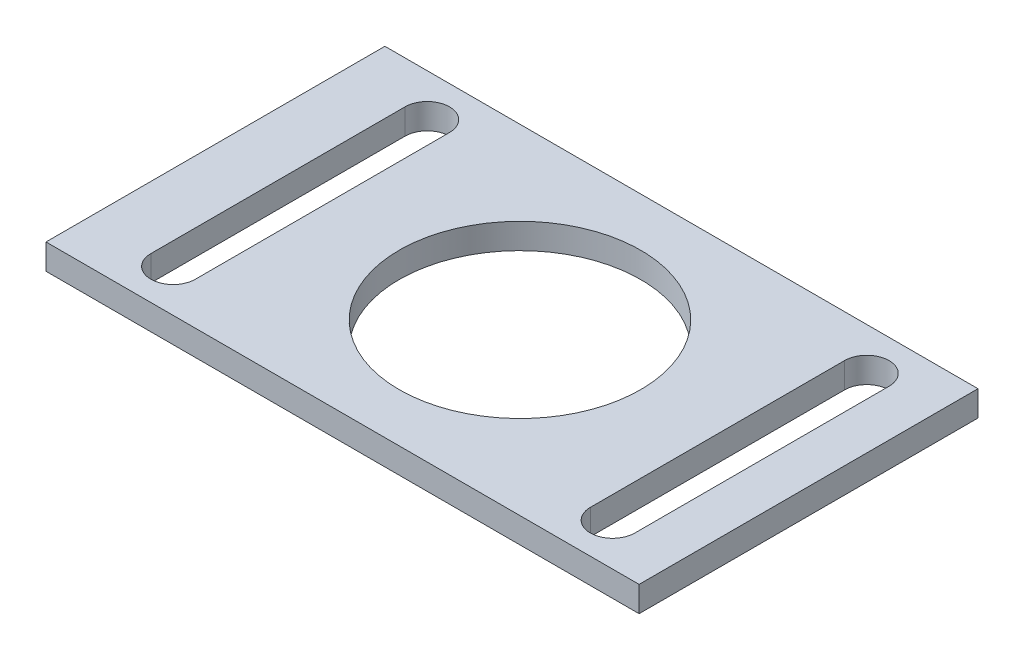
ISO-10303-21;
HEADER;
FILE_DESCRIPTION(('STEP AP214'),'2;1');
FILE_NAME('part.step','',(''),(''),'','','');
FILE_SCHEMA(('AUTOMOTIVE_DESIGN { 1 0 10303 214 1 1 1 1 }'));
ENDSEC;
DATA;
#1=APPLICATION_CONTEXT('core data for automotive mechanical design processes');
#2=APPLICATION_PROTOCOL_DEFINITION('international standard','automotive_design',2000,#1);
#3=PRODUCT_CONTEXT('',#1,'mechanical');
#4=PRODUCT('Part','Part','',(#3));
#5=PRODUCT_RELATED_PRODUCT_CATEGORY('part','',(#4));
#6=PRODUCT_DEFINITION_FORMATION('','',#4);
#7=PRODUCT_DEFINITION_CONTEXT('part definition',#1,'design');
#8=PRODUCT_DEFINITION('design','',#6,#7);
#9=PRODUCT_DEFINITION_SHAPE('','',#8);
#10=(LENGTH_UNIT() NAMED_UNIT(*) SI_UNIT(.MILLI.,.METRE.));
#11=(NAMED_UNIT(*) PLANE_ANGLE_UNIT() SI_UNIT($,.RADIAN.));
#12=(NAMED_UNIT(*) SI_UNIT($,.STERADIAN.) SOLID_ANGLE_UNIT());
#13=UNCERTAINTY_MEASURE_WITH_UNIT(LENGTH_MEASURE(1.E-05),#10,'distance_accuracy_value','');
#14=(GEOMETRIC_REPRESENTATION_CONTEXT(3) GLOBAL_UNCERTAINTY_ASSIGNED_CONTEXT((#13)) GLOBAL_UNIT_ASSIGNED_CONTEXT((#10,
#11,#12)) REPRESENTATION_CONTEXT('',''));
#15=CARTESIAN_POINT('',(0.,0.,0.));
#16=DIRECTION('',(0.,0.,1.));
#17=DIRECTION('',(1.,0.,0.));
#18=AXIS2_PLACEMENT_3D('',#15,#16,#17);
#19=CARTESIAN_POINT('',(0.,3.,0.));
#20=DIRECTION('',(-1.,0.,0.));
#21=DIRECTION('',(0.,0.,1.));
#22=AXIS2_PLACEMENT_3D('',#19,#20,#21);
#23=PLANE('',#22);
#24=DIRECTION('',(0.,0.,-1.));
#25=VECTOR('',#24,1.);
#26=CARTESIAN_POINT('',(0.,0.,0.));
#27=LINE('',#26,#25);
#28=CARTESIAN_POINT('',(0.,0.,0.));
#29=VERTEX_POINT('',#28);
#30=CARTESIAN_POINT('',(0.,0.,-40.));
#31=VERTEX_POINT('',#30);
#32=EDGE_CURVE('E196',#29,#31,#27,.T.);
#33=ORIENTED_EDGE('',*,*,#32,.F.);
#34=DIRECTION('',(0.,-1.,0.));
#35=VECTOR('',#34,1.);
#36=CARTESIAN_POINT('',(0.,3.,0.));
#37=LINE('',#36,#35);
#38=CARTESIAN_POINT('',(0.,3.,0.));
#39=VERTEX_POINT('',#38);
#40=EDGE_CURVE('E11',#39,#29,#37,.T.);
#41=ORIENTED_EDGE('',*,*,#40,.F.);
#42=DIRECTION('',(0.,0.,-1.));
#43=VECTOR('',#42,1.);
#44=CARTESIAN_POINT('',(0.,3.,0.));
#45=LINE('',#44,#43);
#46=CARTESIAN_POINT('',(0.,3.,-40.));
#47=VERTEX_POINT('',#46);
#48=EDGE_CURVE('E199',#39,#47,#45,.T.);
#49=ORIENTED_EDGE('',*,*,#48,.T.);
#50=DIRECTION('',(0.,-1.,0.));
#51=VECTOR('',#50,1.);
#52=CARTESIAN_POINT('',(0.,3.,-40.));
#53=LINE('',#52,#51);
#54=EDGE_CURVE('E45',#47,#31,#53,.T.);
#55=ORIENTED_EDGE('',*,*,#54,.T.);
#56=EDGE_LOOP('',(#33,#41,#49,#55));
#57=FACE_BOUND('',#56,.T.);
#58=ADVANCED_FACE('F39',(#57),#23,.T.);
#59=CARTESIAN_POINT('',(0.,3.,0.));
#60=DIRECTION('',(0.,0.,-1.));
#61=DIRECTION('',(-1.,0.,0.));
#62=AXIS2_PLACEMENT_3D('',#59,#60,#61);
#63=PLANE('',#62);
#64=DIRECTION('',(1.,0.,0.));
#65=VECTOR('',#64,1.);
#66=CARTESIAN_POINT('',(0.,0.,0.));
#67=LINE('',#66,#65);
#68=CARTESIAN_POINT('',(70.,0.,0.));
#69=VERTEX_POINT('',#68);
#70=EDGE_CURVE('E204',#29,#69,#67,.T.);
#71=ORIENTED_EDGE('',*,*,#70,.T.);
#72=DIRECTION('',(0.,-1.,0.));
#73=VECTOR('',#72,1.);
#74=CARTESIAN_POINT('',(70.,3.,0.));
#75=LINE('',#74,#73);
#76=CARTESIAN_POINT('',(70.,3.,0.));
#77=VERTEX_POINT('',#76);
#78=EDGE_CURVE('E50',#77,#69,#75,.T.);
#79=ORIENTED_EDGE('',*,*,#78,.F.);
#80=DIRECTION('',(1.,0.,0.));
#81=VECTOR('',#80,1.);
#82=CARTESIAN_POINT('',(0.,3.,0.));
#83=LINE('',#82,#81);
#84=EDGE_CURVE('E207',#39,#77,#83,.T.);
#85=ORIENTED_EDGE('',*,*,#84,.F.);
#86=ORIENTED_EDGE('',*,*,#40,.T.);
#87=EDGE_LOOP('',(#71,#79,#85,#86));
#88=FACE_BOUND('',#87,.T.);
#89=ADVANCED_FACE('F237',(#88),#63,.F.);
#90=CARTESIAN_POINT('',(70.,3.,0.));
#91=DIRECTION('',(-1.,0.,0.));
#92=DIRECTION('',(0.,0.,1.));
#93=AXIS2_PLACEMENT_3D('',#90,#91,#92);
#94=PLANE('',#93);
#95=DIRECTION('',(0.,0.,-1.));
#96=VECTOR('',#95,1.);
#97=CARTESIAN_POINT('',(70.,0.,0.));
#98=LINE('',#97,#96);
#99=CARTESIAN_POINT('',(70.,0.,-40.));
#100=VERTEX_POINT('',#99);
#101=EDGE_CURVE('E216',#69,#100,#98,.T.);
#102=ORIENTED_EDGE('',*,*,#101,.T.);
#103=DIRECTION('',(0.,-1.,0.));
#104=VECTOR('',#103,1.);
#105=CARTESIAN_POINT('',(70.,3.,-40.));
#106=LINE('',#105,#104);
#107=CARTESIAN_POINT('',(70.,3.,-40.));
#108=VERTEX_POINT('',#107);
#109=EDGE_CURVE('E222',#108,#100,#106,.T.);
#110=ORIENTED_EDGE('',*,*,#109,.F.);
#111=DIRECTION('',(0.,0.,-1.));
#112=VECTOR('',#111,1.);
#113=CARTESIAN_POINT('',(70.,3.,0.));
#114=LINE('',#113,#112);
#115=EDGE_CURVE('E210',#77,#108,#114,.T.);
#116=ORIENTED_EDGE('',*,*,#115,.F.);
#117=ORIENTED_EDGE('',*,*,#78,.T.);
#118=EDGE_LOOP('',(#102,#110,#116,#117));
#119=FACE_BOUND('',#118,.T.);
#120=ADVANCED_FACE('F238',(#119),#94,.F.);
#121=CARTESIAN_POINT('',(0.,3.,-40.));
#122=DIRECTION('',(0.,0.,-1.));
#123=DIRECTION('',(-1.,0.,0.));
#124=AXIS2_PLACEMENT_3D('',#121,#122,#123);
#125=PLANE('',#124);
#126=DIRECTION('',(1.,0.,0.));
#127=VECTOR('',#126,1.);
#128=CARTESIAN_POINT('',(0.,0.,-40.));
#129=LINE('',#128,#127);
#130=EDGE_CURVE('E213',#31,#100,#129,.T.);
#131=ORIENTED_EDGE('',*,*,#130,.F.);
#132=ORIENTED_EDGE('',*,*,#54,.F.);
#133=DIRECTION('',(1.,0.,0.));
#134=VECTOR('',#133,1.);
#135=CARTESIAN_POINT('',(0.,3.,-40.));
#136=LINE('',#135,#134);
#137=EDGE_CURVE('E201',#47,#108,#136,.T.);
#138=ORIENTED_EDGE('',*,*,#137,.T.);
#139=ORIENTED_EDGE('',*,*,#109,.T.);
#140=EDGE_LOOP('',(#131,#132,#138,#139));
#141=FACE_BOUND('',#140,.T.);
#142=ADVANCED_FACE('F230',(#141),#125,.T.);
#143=CARTESIAN_POINT('',(0.,3.,0.));
#144=DIRECTION('',(0.,-1.,0.));
#145=DIRECTION('',(0.,0.,-1.));
#146=AXIS2_PLACEMENT_3D('',#143,#144,#145);
#147=PLANE('',#146);
#148=DIRECTION('',(0.,0.,1.));
#149=VECTOR('',#148,1.);
#150=CARTESIAN_POINT('',(59.25,3.,-35.));
#151=LINE('',#150,#149);
#152=CARTESIAN_POINT('',(59.25,3.,-35.));
#153=VERTEX_POINT('',#152);
#154=CARTESIAN_POINT('',(59.25,3.,-5.));
#155=VERTEX_POINT('',#154);
#156=EDGE_CURVE('E181',#153,#155,#151,.T.);
#157=ORIENTED_EDGE('',*,*,#156,.F.);
#158=CARTESIAN_POINT('',(61.875,3.,-35.));
#159=DIRECTION('',(0.,1.,0.));
#160=DIRECTION('',(0.,0.,1.));
#161=AXIS2_PLACEMENT_3D('',#158,#159,#160);
#162=CIRCLE('',#161,2.625);
#163=CARTESIAN_POINT('',(64.5,3.,-35.));
#164=VERTEX_POINT('',#163);
#165=EDGE_CURVE('E54',#164,#153,#162,.T.);
#166=ORIENTED_EDGE('',*,*,#165,.F.);
#167=DIRECTION('',(0.,0.,-1.));
#168=VECTOR('',#167,1.);
#169=CARTESIAN_POINT('',(64.5,3.,-35.));
#170=LINE('',#169,#168);
#171=CARTESIAN_POINT('',(64.5,3.,-5.));
#172=VERTEX_POINT('',#171);
#173=EDGE_CURVE('E178',#172,#164,#170,.T.);
#174=ORIENTED_EDGE('',*,*,#173,.F.);
#175=CARTESIAN_POINT('',(61.875,3.,-5.));
#176=DIRECTION('',(0.,1.,0.));
#177=DIRECTION('',(0.,0.,1.));
#178=AXIS2_PLACEMENT_3D('',#175,#176,#177);
#179=CIRCLE('',#178,2.625);
#180=EDGE_CURVE('E177',#155,#172,#179,.T.);
#181=ORIENTED_EDGE('',*,*,#180,.F.);
#182=EDGE_LOOP('',(#157,#166,#174,#181));
#183=FACE_BOUND('',#182,.T.);
#184=DIRECTION('',(0.,0.,1.));
#185=VECTOR('',#184,1.);
#186=CARTESIAN_POINT('',(7.375,3.,-35.));
#187=LINE('',#186,#185);
#188=CARTESIAN_POINT('',(7.375,3.,-35.));
#189=VERTEX_POINT('',#188);
#190=CARTESIAN_POINT('',(7.375,3.,-5.));
#191=VERTEX_POINT('',#190);
#192=EDGE_CURVE('E146',#189,#191,#187,.T.);
#193=ORIENTED_EDGE('',*,*,#192,.F.);
#194=CARTESIAN_POINT('',(10.,3.,-35.));
#195=DIRECTION('',(0.,1.,0.));
#196=DIRECTION('',(0.,0.,1.));
#197=AXIS2_PLACEMENT_3D('',#194,#195,#196);
#198=CIRCLE('',#197,2.625);
#199=CARTESIAN_POINT('',(12.625,3.,-35.));
#200=VERTEX_POINT('',#199);
#201=EDGE_CURVE('E62',#200,#189,#198,.T.);
#202=ORIENTED_EDGE('',*,*,#201,.F.);
#203=DIRECTION('',(0.,0.,-1.));
#204=VECTOR('',#203,1.);
#205=CARTESIAN_POINT('',(12.625,3.,-35.));
#206=LINE('',#205,#204);
#207=CARTESIAN_POINT('',(12.625,3.,-5.));
#208=VERTEX_POINT('',#207);
#209=EDGE_CURVE('E140',#208,#200,#206,.T.);
#210=ORIENTED_EDGE('',*,*,#209,.F.);
#211=CARTESIAN_POINT('',(10.,3.,-5.));
#212=DIRECTION('',(0.,1.,0.));
#213=DIRECTION('',(0.,0.,1.));
#214=AXIS2_PLACEMENT_3D('',#211,#212,#213);
#215=CIRCLE('',#214,2.625);
#216=EDGE_CURVE('E142',#191,#208,#215,.T.);
#217=ORIENTED_EDGE('',*,*,#216,.F.);
#218=EDGE_LOOP('',(#193,#202,#210,#217));
#219=FACE_BOUND('',#218,.T.);
#220=CARTESIAN_POINT('',(35.9375,3.,-20.));
#221=DIRECTION('',(0.,1.,0.));
#222=DIRECTION('',(0.,0.,1.));
#223=AXIS2_PLACEMENT_3D('',#220,#221,#222);
#224=CIRCLE('',#223,14.255);
#225=CARTESIAN_POINT('',(35.9375,3.,-5.74499999999999));
#226=VERTEX_POINT('',#225);
#227=EDGE_CURVE('E149',#226,#226,#224,.T.);
#228=ORIENTED_EDGE('',*,*,#227,.F.);
#229=EDGE_LOOP('',(#228));
#230=FACE_BOUND('',#229,.T.);
#231=ORIENTED_EDGE('',*,*,#48,.F.);
#232=ORIENTED_EDGE('',*,*,#84,.T.);
#233=ORIENTED_EDGE('',*,*,#115,.T.);
#234=ORIENTED_EDGE('',*,*,#137,.F.);
#235=EDGE_LOOP('',(#231,#232,#233,#234));
#236=FACE_BOUND('',#235,.T.);
#237=ADVANCED_FACE('F144',(#183,#219,#230,#236),#147,.F.);
#238=CARTESIAN_POINT('',(0.,0.,0.));
#239=DIRECTION('',(0.,-1.,0.));
#240=DIRECTION('',(0.,0.,-1.));
#241=AXIS2_PLACEMENT_3D('',#238,#239,#240);
#242=PLANE('',#241);
#243=CARTESIAN_POINT('',(61.875,0.,-35.));
#244=DIRECTION('',(0.,1.,0.));
#245=DIRECTION('',(0.,0.,1.));
#246=AXIS2_PLACEMENT_3D('',#243,#244,#245);
#247=CIRCLE('',#246,2.625);
#248=CARTESIAN_POINT('',(64.5,0.,-35.));
#249=VERTEX_POINT('',#248);
#250=CARTESIAN_POINT('',(59.25,0.,-35.));
#251=VERTEX_POINT('',#250);
#252=EDGE_CURVE('E179',#249,#251,#247,.T.);
#253=ORIENTED_EDGE('',*,*,#252,.T.);
#254=DIRECTION('',(0.,0.,1.));
#255=VECTOR('',#254,1.);
#256=CARTESIAN_POINT('',(59.25,0.,-35.));
#257=LINE('',#256,#255);
#258=CARTESIAN_POINT('',(59.25,0.,-5.));
#259=VERTEX_POINT('',#258);
#260=EDGE_CURVE('E195',#251,#259,#257,.T.);
#261=ORIENTED_EDGE('',*,*,#260,.T.);
#262=CARTESIAN_POINT('',(61.875,0.,-5.));
#263=DIRECTION('',(0.,1.,0.));
#264=DIRECTION('',(0.,0.,1.));
#265=AXIS2_PLACEMENT_3D('',#262,#263,#264);
#266=CIRCLE('',#265,2.625);
#267=CARTESIAN_POINT('',(64.5,0.,-5.));
#268=VERTEX_POINT('',#267);
#269=EDGE_CURVE('E190',#259,#268,#266,.T.);
#270=ORIENTED_EDGE('',*,*,#269,.T.);
#271=DIRECTION('',(0.,0.,-1.));
#272=VECTOR('',#271,1.);
#273=CARTESIAN_POINT('',(64.5,0.,-35.));
#274=LINE('',#273,#272);
#275=EDGE_CURVE('E166',#268,#249,#274,.T.);
#276=ORIENTED_EDGE('',*,*,#275,.T.);
#277=EDGE_LOOP('',(#253,#261,#270,#276));
#278=FACE_BOUND('',#277,.T.);
#279=CARTESIAN_POINT('',(10.,0.,-35.));
#280=DIRECTION('',(0.,1.,0.));
#281=DIRECTION('',(0.,0.,1.));
#282=AXIS2_PLACEMENT_3D('',#279,#280,#281);
#283=CIRCLE('',#282,2.625);
#284=CARTESIAN_POINT('',(12.625,0.,-35.));
#285=VERTEX_POINT('',#284);
#286=CARTESIAN_POINT('',(7.375,0.,-35.));
#287=VERTEX_POINT('',#286);
#288=EDGE_CURVE('E128',#285,#287,#283,.T.);
#289=ORIENTED_EDGE('',*,*,#288,.T.);
#290=DIRECTION('',(0.,0.,1.));
#291=VECTOR('',#290,1.);
#292=CARTESIAN_POINT('',(7.375,0.,-35.));
#293=LINE('',#292,#291);
#294=CARTESIAN_POINT('',(7.375,0.,-5.));
#295=VERTEX_POINT('',#294);
#296=EDGE_CURVE('E162',#287,#295,#293,.T.);
#297=ORIENTED_EDGE('',*,*,#296,.T.);
#298=CARTESIAN_POINT('',(10.,0.,-5.));
#299=DIRECTION('',(0.,1.,0.));
#300=DIRECTION('',(0.,0.,1.));
#301=AXIS2_PLACEMENT_3D('',#298,#299,#300);
#302=CIRCLE('',#301,2.625);
#303=CARTESIAN_POINT('',(12.625,0.,-5.));
#304=VERTEX_POINT('',#303);
#305=EDGE_CURVE('E157',#295,#304,#302,.T.);
#306=ORIENTED_EDGE('',*,*,#305,.T.);
#307=DIRECTION('',(0.,0.,-1.));
#308=VECTOR('',#307,1.);
#309=CARTESIAN_POINT('',(12.625,0.,-35.));
#310=LINE('',#309,#308);
#311=EDGE_CURVE('E160',#304,#285,#310,.T.);
#312=ORIENTED_EDGE('',*,*,#311,.T.);
#313=EDGE_LOOP('',(#289,#297,#306,#312));
#314=FACE_BOUND('',#313,.T.);
#315=CARTESIAN_POINT('',(35.9375,0.,-20.));
#316=DIRECTION('',(0.,1.,0.));
#317=DIRECTION('',(0.,0.,1.));
#318=AXIS2_PLACEMENT_3D('',#315,#316,#317);
#319=CIRCLE('',#318,14.255);
#320=CARTESIAN_POINT('',(35.9375,0.,-5.74499999999999));
#321=VERTEX_POINT('',#320);
#322=EDGE_CURVE('E155',#321,#321,#319,.T.);
#323=ORIENTED_EDGE('',*,*,#322,.T.);
#324=EDGE_LOOP('',(#323));
#325=FACE_BOUND('',#324,.T.);
#326=ORIENTED_EDGE('',*,*,#32,.T.);
#327=ORIENTED_EDGE('',*,*,#130,.T.);
#328=ORIENTED_EDGE('',*,*,#101,.F.);
#329=ORIENTED_EDGE('',*,*,#70,.F.);
#330=EDGE_LOOP('',(#326,#327,#328,#329));
#331=FACE_BOUND('',#330,.T.);
#332=ADVANCED_FACE('F231',(#278,#314,#325,#331),#242,.T.);
#333=CARTESIAN_POINT('',(35.9375,0.,-20.));
#334=DIRECTION('',(0.,1.,0.));
#335=DIRECTION('',(0.,0.,1.));
#336=AXIS2_PLACEMENT_3D('',#333,#334,#335);
#337=CYLINDRICAL_SURFACE('',#336,14.255);
#338=ORIENTED_EDGE('',*,*,#322,.F.);
#339=EDGE_LOOP('',(#338));
#340=FACE_BOUND('',#339,.T.);
#341=ORIENTED_EDGE('',*,*,#227,.T.);
#342=EDGE_LOOP('',(#341));
#343=FACE_BOUND('',#342,.T.);
#344=ADVANCED_FACE('F247',(#340,#343),#337,.F.);
#345=CARTESIAN_POINT('',(10.,0.,-35.));
#346=DIRECTION('',(0.,1.,0.));
#347=DIRECTION('',(0.,0.,1.));
#348=AXIS2_PLACEMENT_3D('',#345,#346,#347);
#349=CYLINDRICAL_SURFACE('',#348,2.625);
#350=ORIENTED_EDGE('',*,*,#201,.T.);
#351=DIRECTION('',(0.,1.,0.));
#352=VECTOR('',#351,1.);
#353=CARTESIAN_POINT('',(7.375,0.,-35.));
#354=LINE('',#353,#352);
#355=EDGE_CURVE('E159',#287,#189,#354,.T.);
#356=ORIENTED_EDGE('',*,*,#355,.F.);
#357=ORIENTED_EDGE('',*,*,#288,.F.);
#358=DIRECTION('',(0.,1.,0.));
#359=VECTOR('',#358,1.);
#360=CARTESIAN_POINT('',(12.625,0.,-35.));
#361=LINE('',#360,#359);
#362=EDGE_CURVE('E127',#285,#200,#361,.T.);
#363=ORIENTED_EDGE('',*,*,#362,.T.);
#364=EDGE_LOOP('',(#350,#356,#357,#363));
#365=FACE_BOUND('',#364,.T.);
#366=ADVANCED_FACE('F126',(#365),#349,.F.);
#367=CARTESIAN_POINT('',(12.625,0.,-35.));
#368=DIRECTION('',(1.,0.,0.));
#369=DIRECTION('',(0.,0.,-1.));
#370=AXIS2_PLACEMENT_3D('',#367,#368,#369);
#371=PLANE('',#370);
#372=ORIENTED_EDGE('',*,*,#209,.T.);
#373=ORIENTED_EDGE('',*,*,#362,.F.);
#374=ORIENTED_EDGE('',*,*,#311,.F.);
#375=DIRECTION('',(0.,1.,0.));
#376=VECTOR('',#375,1.);
#377=CARTESIAN_POINT('',(12.625,0.,-5.));
#378=LINE('',#377,#376);
#379=EDGE_CURVE('E135',#304,#208,#378,.T.);
#380=ORIENTED_EDGE('',*,*,#379,.T.);
#381=EDGE_LOOP('',(#372,#373,#374,#380));
#382=FACE_BOUND('',#381,.T.);
#383=ADVANCED_FACE('F136',(#382),#371,.F.);
#384=CARTESIAN_POINT('',(10.,0.,-5.));
#385=DIRECTION('',(0.,1.,0.));
#386=DIRECTION('',(0.,0.,1.));
#387=AXIS2_PLACEMENT_3D('',#384,#385,#386);
#388=CYLINDRICAL_SURFACE('',#387,2.625);
#389=ORIENTED_EDGE('',*,*,#216,.T.);
#390=ORIENTED_EDGE('',*,*,#379,.F.);
#391=ORIENTED_EDGE('',*,*,#305,.F.);
#392=DIRECTION('',(0.,1.,0.));
#393=VECTOR('',#392,1.);
#394=CARTESIAN_POINT('',(7.375,0.,-5.));
#395=LINE('',#394,#393);
#396=EDGE_CURVE('E379',#295,#191,#395,.T.);
#397=ORIENTED_EDGE('',*,*,#396,.T.);
#398=EDGE_LOOP('',(#389,#390,#391,#397));
#399=FACE_BOUND('',#398,.T.);
#400=ADVANCED_FACE('F308',(#399),#388,.F.);
#401=CARTESIAN_POINT('',(7.375,0.,-35.));
#402=DIRECTION('',(-1.,0.,0.));
#403=DIRECTION('',(0.,0.,1.));
#404=AXIS2_PLACEMENT_3D('',#401,#402,#403);
#405=PLANE('',#404);
#406=ORIENTED_EDGE('',*,*,#192,.T.);
#407=ORIENTED_EDGE('',*,*,#396,.F.);
#408=ORIENTED_EDGE('',*,*,#296,.F.);
#409=ORIENTED_EDGE('',*,*,#355,.T.);
#410=EDGE_LOOP('',(#406,#407,#408,#409));
#411=FACE_BOUND('',#410,.T.);
#412=ADVANCED_FACE('F312',(#411),#405,.F.);
#413=CARTESIAN_POINT('',(61.875,0.,-35.));
#414=DIRECTION('',(0.,1.,0.));
#415=DIRECTION('',(0.,0.,1.));
#416=AXIS2_PLACEMENT_3D('',#413,#414,#415);
#417=CYLINDRICAL_SURFACE('',#416,2.625);
#418=ORIENTED_EDGE('',*,*,#165,.T.);
#419=DIRECTION('',(0.,1.,0.));
#420=VECTOR('',#419,1.);
#421=CARTESIAN_POINT('',(59.25,0.,-35.));
#422=LINE('',#421,#420);
#423=EDGE_CURVE('E170',#251,#153,#422,.T.);
#424=ORIENTED_EDGE('',*,*,#423,.F.);
#425=ORIENTED_EDGE('',*,*,#252,.F.);
#426=DIRECTION('',(0.,1.,0.));
#427=VECTOR('',#426,1.);
#428=CARTESIAN_POINT('',(64.5,0.,-35.));
#429=LINE('',#428,#427);
#430=EDGE_CURVE('E175',#249,#164,#429,.T.);
#431=ORIENTED_EDGE('',*,*,#430,.T.);
#432=EDGE_LOOP('',(#418,#424,#425,#431));
#433=FACE_BOUND('',#432,.T.);
#434=ADVANCED_FACE('F324',(#433),#417,.F.);
#435=CARTESIAN_POINT('',(64.5,0.,-35.));
#436=DIRECTION('',(1.,0.,0.));
#437=DIRECTION('',(0.,0.,-1.));
#438=AXIS2_PLACEMENT_3D('',#435,#436,#437);
#439=PLANE('',#438);
#440=ORIENTED_EDGE('',*,*,#173,.T.);
#441=ORIENTED_EDGE('',*,*,#430,.F.);
#442=ORIENTED_EDGE('',*,*,#275,.F.);
#443=DIRECTION('',(0.,1.,0.));
#444=VECTOR('',#443,1.);
#445=CARTESIAN_POINT('',(64.5,0.,-5.));
#446=LINE('',#445,#444);
#447=EDGE_CURVE('E174',#268,#172,#446,.T.);
#448=ORIENTED_EDGE('',*,*,#447,.T.);
#449=EDGE_LOOP('',(#440,#441,#442,#448));
#450=FACE_BOUND('',#449,.T.);
#451=ADVANCED_FACE('F333',(#450),#439,.F.);
#452=CARTESIAN_POINT('',(61.875,0.,-5.));
#453=DIRECTION('',(0.,1.,0.));
#454=DIRECTION('',(0.,0.,1.));
#455=AXIS2_PLACEMENT_3D('',#452,#453,#454);
#456=CYLINDRICAL_SURFACE('',#455,2.625);
#457=ORIENTED_EDGE('',*,*,#180,.T.);
#458=ORIENTED_EDGE('',*,*,#447,.F.);
#459=ORIENTED_EDGE('',*,*,#269,.F.);
#460=DIRECTION('',(0.,1.,0.));
#461=VECTOR('',#460,1.);
#462=CARTESIAN_POINT('',(59.25,0.,-5.));
#463=LINE('',#462,#461);
#464=EDGE_CURVE('E168',#259,#155,#463,.T.);
#465=ORIENTED_EDGE('',*,*,#464,.T.);
#466=EDGE_LOOP('',(#457,#458,#459,#465));
#467=FACE_BOUND('',#466,.T.);
#468=ADVANCED_FACE('F342',(#467),#456,.F.);
#469=CARTESIAN_POINT('',(59.25,0.,-35.));
#470=DIRECTION('',(-1.,0.,0.));
#471=DIRECTION('',(0.,0.,1.));
#472=AXIS2_PLACEMENT_3D('',#469,#470,#471);
#473=PLANE('',#472);
#474=ORIENTED_EDGE('',*,*,#156,.T.);
#475=ORIENTED_EDGE('',*,*,#464,.F.);
#476=ORIENTED_EDGE('',*,*,#260,.F.);
#477=ORIENTED_EDGE('',*,*,#423,.T.);
#478=EDGE_LOOP('',(#474,#475,#476,#477));
#479=FACE_BOUND('',#478,.T.);
#480=ADVANCED_FACE('F355',(#479),#473,.F.);
#481=CLOSED_SHELL('',(#58,#89,#120,#142,#237,#332,#344,#366,#383,#400,#412,#434,#451,#468,#480));
#482=MANIFOLD_SOLID_BREP('B2',#481);
#483=ADVANCED_BREP_SHAPE_REPRESENTATION('',(#18,#482),#14);
#484=SHAPE_DEFINITION_REPRESENTATION(#9,#483);
ENDSEC;
END-ISO-10303-21;
